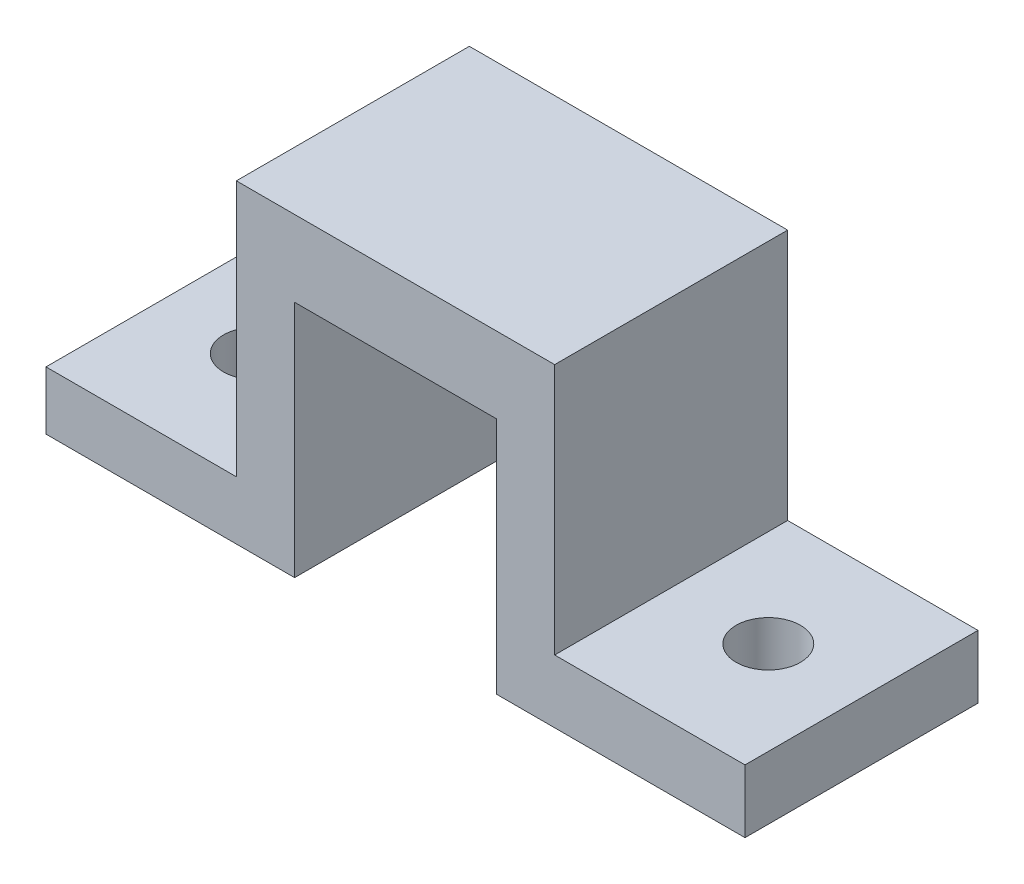
ISO-10303-21;
HEADER;
FILE_DESCRIPTION(('STEP AP214'),'2;1');
FILE_NAME('part.step','',(''),(''),'','','');
FILE_SCHEMA(('AUTOMOTIVE_DESIGN { 1 0 10303 214 1 1 1 1 }'));
ENDSEC;
DATA;
#1=APPLICATION_CONTEXT('core data for automotive mechanical design processes');
#2=APPLICATION_PROTOCOL_DEFINITION('international standard','automotive_design',2000,#1);
#3=PRODUCT_CONTEXT('',#1,'mechanical');
#4=PRODUCT('Part','Part','',(#3));
#5=PRODUCT_RELATED_PRODUCT_CATEGORY('part','',(#4));
#6=PRODUCT_DEFINITION_FORMATION('','',#4);
#7=PRODUCT_DEFINITION_CONTEXT('part definition',#1,'design');
#8=PRODUCT_DEFINITION('design','',#6,#7);
#9=PRODUCT_DEFINITION_SHAPE('','',#8);
#10=(LENGTH_UNIT() NAMED_UNIT(*) SI_UNIT(.MILLI.,.METRE.));
#11=(NAMED_UNIT(*) PLANE_ANGLE_UNIT() SI_UNIT($,.RADIAN.));
#12=(NAMED_UNIT(*) SI_UNIT($,.STERADIAN.) SOLID_ANGLE_UNIT());
#13=UNCERTAINTY_MEASURE_WITH_UNIT(LENGTH_MEASURE(1.E-05),#10,'distance_accuracy_value','');
#14=(GEOMETRIC_REPRESENTATION_CONTEXT(3) GLOBAL_UNCERTAINTY_ASSIGNED_CONTEXT((#13)) GLOBAL_UNIT_ASSIGNED_CONTEXT((#10,
#11,#12)) REPRESENTATION_CONTEXT('',''));
#15=CARTESIAN_POINT('',(0.,0.,0.));
#16=DIRECTION('',(0.,0.,1.));
#17=DIRECTION('',(1.,0.,0.));
#18=AXIS2_PLACEMENT_3D('',#15,#16,#17);
#19=CARTESIAN_POINT('',(5.5,-6.5,12.7));
#20=DIRECTION('',(1.,0.,0.));
#21=DIRECTION('',(0.,0.,-1.));
#22=AXIS2_PLACEMENT_3D('',#19,#20,#21);
#23=PLANE('',#22);
#24=DIRECTION('',(0.,-1.,0.));
#25=VECTOR('',#24,1.);
#26=CARTESIAN_POINT('',(5.5,-6.5,0.));
#27=LINE('',#26,#25);
#28=CARTESIAN_POINT('',(5.5,6.5,0.));
#29=VERTEX_POINT('',#28);
#30=CARTESIAN_POINT('',(5.5,-6.5,0.));
#31=VERTEX_POINT('',#30);
#32=EDGE_CURVE('E152',#29,#31,#27,.T.);
#33=ORIENTED_EDGE('',*,*,#32,.T.);
#34=DIRECTION('',(0.,0.,-1.));
#35=VECTOR('',#34,1.);
#36=CARTESIAN_POINT('',(5.5,-6.5,12.7));
#37=LINE('',#36,#35);
#38=CARTESIAN_POINT('',(5.5,-6.5,12.7));
#39=VERTEX_POINT('',#38);
#40=EDGE_CURVE('E11',#39,#31,#37,.T.);
#41=ORIENTED_EDGE('',*,*,#40,.F.);
#42=DIRECTION('',(0.,-1.,0.));
#43=VECTOR('',#42,1.);
#44=CARTESIAN_POINT('',(5.5,-6.5,12.7));
#45=LINE('',#44,#43);
#46=CARTESIAN_POINT('',(5.5,6.5,12.7));
#47=VERTEX_POINT('',#46);
#48=EDGE_CURVE('E175',#47,#39,#45,.T.);
#49=ORIENTED_EDGE('',*,*,#48,.F.);
#50=DIRECTION('',(0.,0.,-1.));
#51=VECTOR('',#50,1.);
#52=CARTESIAN_POINT('',(5.5,6.5,12.7));
#53=LINE('',#52,#51);
#54=EDGE_CURVE('E148',#47,#29,#53,.T.);
#55=ORIENTED_EDGE('',*,*,#54,.T.);
#56=EDGE_LOOP('',(#33,#41,#49,#55));
#57=FACE_BOUND('',#56,.T.);
#58=ADVANCED_FACE('F32',(#57),#23,.F.);
#59=CARTESIAN_POINT('',(19.05,-6.5,12.7));
#60=DIRECTION('',(0.,1.,0.));
#61=DIRECTION('',(-1.,0.,0.));
#62=AXIS2_PLACEMENT_3D('',#59,#60,#61);
#63=PLANE('',#62);
#64=CARTESIAN_POINT('',(13.97,-6.5,6.35));
#65=DIRECTION('',(0.,1.,0.));
#66=DIRECTION('',(0.,0.,1.));
#67=AXIS2_PLACEMENT_3D('',#64,#65,#66);
#68=CIRCLE('',#67,1.7526);
#69=CARTESIAN_POINT('',(13.97,-6.5,8.1026));
#70=VERTEX_POINT('',#69);
#71=EDGE_CURVE('E292',#70,#70,#68,.T.);
#72=ORIENTED_EDGE('',*,*,#71,.T.);
#73=EDGE_LOOP('',(#72));
#74=FACE_BOUND('',#73,.T.);
#75=DIRECTION('',(1.,0.,0.));
#76=VECTOR('',#75,1.);
#77=CARTESIAN_POINT('',(19.05,-6.5,0.));
#78=LINE('',#77,#76);
#79=CARTESIAN_POINT('',(19.05,-6.5,0.));
#80=VERTEX_POINT('',#79);
#81=EDGE_CURVE('E155',#31,#80,#78,.T.);
#82=ORIENTED_EDGE('',*,*,#81,.T.);
#83=DIRECTION('',(0.,0.,-1.));
#84=VECTOR('',#83,1.);
#85=CARTESIAN_POINT('',(19.05,-6.5,12.7));
#86=LINE('',#85,#84);
#87=CARTESIAN_POINT('',(19.05,-6.5,12.7));
#88=VERTEX_POINT('',#87);
#89=EDGE_CURVE('E40',#88,#80,#86,.T.);
#90=ORIENTED_EDGE('',*,*,#89,.F.);
#91=DIRECTION('',(1.,0.,0.));
#92=VECTOR('',#91,1.);
#93=CARTESIAN_POINT('',(19.05,-6.5,12.7));
#94=LINE('',#93,#92);
#95=EDGE_CURVE('E103',#39,#88,#94,.T.);
#96=ORIENTED_EDGE('',*,*,#95,.F.);
#97=ORIENTED_EDGE('',*,*,#40,.T.);
#98=EDGE_LOOP('',(#82,#90,#96,#97));
#99=FACE_BOUND('',#98,.T.);
#100=ADVANCED_FACE('F253',(#74,#99),#63,.F.);
#101=CARTESIAN_POINT('',(19.05,-3.06304910198319,12.7));
#102=DIRECTION('',(-1.,0.,0.));
#103=DIRECTION('',(0.,0.,1.));
#104=AXIS2_PLACEMENT_3D('',#101,#102,#103);
#105=PLANE('',#104);
#106=DIRECTION('',(0.,1.,0.));
#107=VECTOR('',#106,1.);
#108=CARTESIAN_POINT('',(19.05,-3.06304910198319,0.));
#109=LINE('',#108,#107);
#110=CARTESIAN_POINT('',(19.05,-3.06304910198319,0.));
#111=VERTEX_POINT('',#110);
#112=EDGE_CURVE('E158',#80,#111,#109,.T.);
#113=ORIENTED_EDGE('',*,*,#112,.T.);
#114=DIRECTION('',(0.,0.,-1.));
#115=VECTOR('',#114,1.);
#116=CARTESIAN_POINT('',(19.05,-3.06304910198319,12.7));
#117=LINE('',#116,#115);
#118=CARTESIAN_POINT('',(19.05,-3.06304910198319,12.7));
#119=VERTEX_POINT('',#118);
#120=EDGE_CURVE('E194',#119,#111,#117,.T.);
#121=ORIENTED_EDGE('',*,*,#120,.F.);
#122=DIRECTION('',(0.,1.,0.));
#123=VECTOR('',#122,1.);
#124=CARTESIAN_POINT('',(19.05,-3.06304910198319,12.7));
#125=LINE('',#124,#123);
#126=EDGE_CURVE('E202',#88,#119,#125,.T.);
#127=ORIENTED_EDGE('',*,*,#126,.F.);
#128=ORIENTED_EDGE('',*,*,#89,.T.);
#129=EDGE_LOOP('',(#113,#121,#127,#128));
#130=FACE_BOUND('',#129,.T.);
#131=ADVANCED_FACE('F200',(#130),#105,.F.);
#132=CARTESIAN_POINT('',(8.675,-3.06304910198319,12.7));
#133=DIRECTION('',(0.,-1.,0.));
#134=DIRECTION('',(0.,0.,-1.));
#135=AXIS2_PLACEMENT_3D('',#132,#133,#134);
#136=PLANE('',#135);
#137=CARTESIAN_POINT('',(13.97,-3.06304910198319,6.35));
#138=DIRECTION('',(0.,1.,0.));
#139=DIRECTION('',(0.,0.,1.));
#140=AXIS2_PLACEMENT_3D('',#137,#138,#139);
#141=CIRCLE('',#140,1.7526);
#142=CARTESIAN_POINT('',(13.97,-3.06304910198319,8.1026));
#143=VERTEX_POINT('',#142);
#144=EDGE_CURVE('E295',#143,#143,#141,.T.);
#145=ORIENTED_EDGE('',*,*,#144,.F.);
#146=EDGE_LOOP('',(#145));
#147=FACE_BOUND('',#146,.T.);
#148=DIRECTION('',(-1.,0.,0.));
#149=VECTOR('',#148,1.);
#150=CARTESIAN_POINT('',(8.675,-3.06304910198319,0.));
#151=LINE('',#150,#149);
#152=CARTESIAN_POINT('',(8.675,-3.06304910198319,0.));
#153=VERTEX_POINT('',#152);
#154=EDGE_CURVE('E160',#111,#153,#151,.T.);
#155=ORIENTED_EDGE('',*,*,#154,.T.);
#156=DIRECTION('',(0.,0.,-1.));
#157=VECTOR('',#156,1.);
#158=CARTESIAN_POINT('',(8.675,-3.06304910198319,12.7));
#159=LINE('',#158,#157);
#160=CARTESIAN_POINT('',(8.675,-3.06304910198319,12.7));
#161=VERTEX_POINT('',#160);
#162=EDGE_CURVE('E191',#161,#153,#159,.T.);
#163=ORIENTED_EDGE('',*,*,#162,.F.);
#164=DIRECTION('',(-1.,0.,0.));
#165=VECTOR('',#164,1.);
#166=CARTESIAN_POINT('',(8.675,-3.06304910198319,12.7));
#167=LINE('',#166,#165);
#168=EDGE_CURVE('E220',#119,#161,#167,.T.);
#169=ORIENTED_EDGE('',*,*,#168,.F.);
#170=ORIENTED_EDGE('',*,*,#120,.T.);
#171=EDGE_LOOP('',(#155,#163,#169,#170));
#172=FACE_BOUND('',#171,.T.);
#173=ADVANCED_FACE('F211',(#147,#172),#136,.F.);
#174=CARTESIAN_POINT('',(8.675,10.645,12.7));
#175=DIRECTION('',(-1.,0.,0.));
#176=DIRECTION('',(0.,-1.,0.));
#177=AXIS2_PLACEMENT_3D('',#174,#175,#176);
#178=PLANE('',#177);
#179=DIRECTION('',(0.,1.,0.));
#180=VECTOR('',#179,1.);
#181=CARTESIAN_POINT('',(8.675,10.645,0.));
#182=LINE('',#181,#180);
#183=CARTESIAN_POINT('',(8.675,10.645,0.));
#184=VERTEX_POINT('',#183);
#185=EDGE_CURVE('E162',#153,#184,#182,.T.);
#186=ORIENTED_EDGE('',*,*,#185,.T.);
#187=DIRECTION('',(0.,0.,-1.));
#188=VECTOR('',#187,1.);
#189=CARTESIAN_POINT('',(8.675,10.645,12.7));
#190=LINE('',#189,#188);
#191=CARTESIAN_POINT('',(8.675,10.645,12.7));
#192=VERTEX_POINT('',#191);
#193=EDGE_CURVE('E188',#192,#184,#190,.T.);
#194=ORIENTED_EDGE('',*,*,#193,.F.);
#195=DIRECTION('',(0.,1.,0.));
#196=VECTOR('',#195,1.);
#197=CARTESIAN_POINT('',(8.675,10.645,12.7));
#198=LINE('',#197,#196);
#199=EDGE_CURVE('E217',#161,#192,#198,.T.);
#200=ORIENTED_EDGE('',*,*,#199,.F.);
#201=ORIENTED_EDGE('',*,*,#162,.T.);
#202=EDGE_LOOP('',(#186,#194,#200,#201));
#203=FACE_BOUND('',#202,.T.);
#204=ADVANCED_FACE('F215',(#203),#178,.F.);
#205=CARTESIAN_POINT('',(-8.675,10.645,12.7));
#206=DIRECTION('',(0.,-1.,0.));
#207=DIRECTION('',(0.,0.,-1.));
#208=AXIS2_PLACEMENT_3D('',#205,#206,#207);
#209=PLANE('',#208);
#210=DIRECTION('',(-1.,0.,0.));
#211=VECTOR('',#210,1.);
#212=CARTESIAN_POINT('',(-8.675,10.645,0.));
#213=LINE('',#212,#211);
#214=CARTESIAN_POINT('',(-8.675,10.645,0.));
#215=VERTEX_POINT('',#214);
#216=EDGE_CURVE('E164',#184,#215,#213,.T.);
#217=ORIENTED_EDGE('',*,*,#216,.T.);
#218=DIRECTION('',(0.,0.,-1.));
#219=VECTOR('',#218,1.);
#220=CARTESIAN_POINT('',(-8.675,10.645,12.7));
#221=LINE('',#220,#219);
#222=CARTESIAN_POINT('',(-8.675,10.645,12.7));
#223=VERTEX_POINT('',#222);
#224=EDGE_CURVE('E185',#223,#215,#221,.T.);
#225=ORIENTED_EDGE('',*,*,#224,.F.);
#226=DIRECTION('',(-1.,0.,0.));
#227=VECTOR('',#226,1.);
#228=CARTESIAN_POINT('',(-8.675,10.645,12.7));
#229=LINE('',#228,#227);
#230=EDGE_CURVE('E219',#192,#223,#229,.T.);
#231=ORIENTED_EDGE('',*,*,#230,.F.);
#232=ORIENTED_EDGE('',*,*,#193,.T.);
#233=EDGE_LOOP('',(#217,#225,#231,#232));
#234=FACE_BOUND('',#233,.T.);
#235=ADVANCED_FACE('F269',(#234),#209,.F.);
#236=CARTESIAN_POINT('',(-8.675,-3.325,12.7));
#237=DIRECTION('',(1.,0.,0.));
#238=DIRECTION('',(0.,0.,-1.));
#239=AXIS2_PLACEMENT_3D('',#236,#237,#238);
#240=PLANE('',#239);
#241=DIRECTION('',(0.,-1.,0.));
#242=VECTOR('',#241,1.);
#243=CARTESIAN_POINT('',(-8.675,-3.325,0.));
#244=LINE('',#243,#242);
#245=CARTESIAN_POINT('',(-8.675,-3.325,0.));
#246=VERTEX_POINT('',#245);
#247=EDGE_CURVE('E166',#215,#246,#244,.T.);
#248=ORIENTED_EDGE('',*,*,#247,.T.);
#249=DIRECTION('',(0.,0.,-1.));
#250=VECTOR('',#249,1.);
#251=CARTESIAN_POINT('',(-8.675,-3.325,12.7));
#252=LINE('',#251,#250);
#253=CARTESIAN_POINT('',(-8.675,-3.325,12.7));
#254=VERTEX_POINT('',#253);
#255=EDGE_CURVE('E182',#254,#246,#252,.T.);
#256=ORIENTED_EDGE('',*,*,#255,.F.);
#257=DIRECTION('',(0.,-1.,0.));
#258=VECTOR('',#257,1.);
#259=CARTESIAN_POINT('',(-8.675,-3.325,12.7));
#260=LINE('',#259,#258);
#261=EDGE_CURVE('E222',#223,#254,#260,.T.);
#262=ORIENTED_EDGE('',*,*,#261,.F.);
#263=ORIENTED_EDGE('',*,*,#224,.T.);
#264=EDGE_LOOP('',(#248,#256,#262,#263));
#265=FACE_BOUND('',#264,.T.);
#266=ADVANCED_FACE('F272',(#265),#240,.F.);
#267=CARTESIAN_POINT('',(-19.05,-3.325,12.7));
#268=DIRECTION('',(0.,-1.,0.));
#269=DIRECTION('',(0.,0.,-1.));
#270=AXIS2_PLACEMENT_3D('',#267,#268,#269);
#271=PLANE('',#270);
#272=CARTESIAN_POINT('',(-13.97,-3.325,6.35));
#273=DIRECTION('',(0.,1.,0.));
#274=DIRECTION('',(0.,0.,1.));
#275=AXIS2_PLACEMENT_3D('',#272,#273,#274);
#276=CIRCLE('',#275,1.7526);
#277=CARTESIAN_POINT('',(-13.97,-3.325,8.1026));
#278=VERTEX_POINT('',#277);
#279=EDGE_CURVE('E289',#278,#278,#276,.T.);
#280=ORIENTED_EDGE('',*,*,#279,.F.);
#281=EDGE_LOOP('',(#280));
#282=FACE_BOUND('',#281,.T.);
#283=DIRECTION('',(-1.,0.,0.));
#284=VECTOR('',#283,1.);
#285=CARTESIAN_POINT('',(-19.05,-3.325,0.));
#286=LINE('',#285,#284);
#287=CARTESIAN_POINT('',(-19.05,-3.325,0.));
#288=VERTEX_POINT('',#287);
#289=EDGE_CURVE('E168',#246,#288,#286,.T.);
#290=ORIENTED_EDGE('',*,*,#289,.T.);
#291=DIRECTION('',(0.,0.,-1.));
#292=VECTOR('',#291,1.);
#293=CARTESIAN_POINT('',(-19.05,-3.325,12.7));
#294=LINE('',#293,#292);
#295=CARTESIAN_POINT('',(-19.05,-3.325,12.7));
#296=VERTEX_POINT('',#295);
#297=EDGE_CURVE('E179',#296,#288,#294,.T.);
#298=ORIENTED_EDGE('',*,*,#297,.F.);
#299=DIRECTION('',(-1.,0.,0.));
#300=VECTOR('',#299,1.);
#301=CARTESIAN_POINT('',(-19.05,-3.325,12.7));
#302=LINE('',#301,#300);
#303=EDGE_CURVE('E228',#254,#296,#302,.T.);
#304=ORIENTED_EDGE('',*,*,#303,.F.);
#305=ORIENTED_EDGE('',*,*,#255,.T.);
#306=EDGE_LOOP('',(#290,#298,#304,#305));
#307=FACE_BOUND('',#306,.T.);
#308=ADVANCED_FACE('F234',(#282,#307),#271,.F.);
#309=CARTESIAN_POINT('',(-19.05,-6.5,12.7));
#310=DIRECTION('',(1.,0.,0.));
#311=DIRECTION('',(0.,0.,-1.));
#312=AXIS2_PLACEMENT_3D('',#309,#310,#311);
#313=PLANE('',#312);
#314=DIRECTION('',(0.,-1.,0.));
#315=VECTOR('',#314,1.);
#316=CARTESIAN_POINT('',(-19.05,-6.5,0.));
#317=LINE('',#316,#315);
#318=CARTESIAN_POINT('',(-19.05,-6.5,0.));
#319=VERTEX_POINT('',#318);
#320=EDGE_CURVE('E170',#288,#319,#317,.T.);
#321=ORIENTED_EDGE('',*,*,#320,.T.);
#322=DIRECTION('',(0.,0.,-1.));
#323=VECTOR('',#322,1.);
#324=CARTESIAN_POINT('',(-19.05,-6.5,12.7));
#325=LINE('',#324,#323);
#326=CARTESIAN_POINT('',(-19.05,-6.5,12.7));
#327=VERTEX_POINT('',#326);
#328=EDGE_CURVE('E143',#327,#319,#325,.T.);
#329=ORIENTED_EDGE('',*,*,#328,.F.);
#330=DIRECTION('',(0.,-1.,0.));
#331=VECTOR('',#330,1.);
#332=CARTESIAN_POINT('',(-19.05,-6.5,12.7));
#333=LINE('',#332,#331);
#334=EDGE_CURVE('E134',#296,#327,#333,.T.);
#335=ORIENTED_EDGE('',*,*,#334,.F.);
#336=ORIENTED_EDGE('',*,*,#297,.T.);
#337=EDGE_LOOP('',(#321,#329,#335,#336));
#338=FACE_BOUND('',#337,.T.);
#339=ADVANCED_FACE('F238',(#338),#313,.F.);
#340=CARTESIAN_POINT('',(-5.5,-6.5,12.7));
#341=DIRECTION('',(0.,1.,0.));
#342=DIRECTION('',(-1.,0.,0.));
#343=AXIS2_PLACEMENT_3D('',#340,#341,#342);
#344=PLANE('',#343);
#345=CARTESIAN_POINT('',(-13.97,-6.5,6.35));
#346=DIRECTION('',(0.,1.,0.));
#347=DIRECTION('',(0.,0.,1.));
#348=AXIS2_PLACEMENT_3D('',#345,#346,#347);
#349=CIRCLE('',#348,1.7526);
#350=CARTESIAN_POINT('',(-13.97,-6.5,8.1026));
#351=VERTEX_POINT('',#350);
#352=EDGE_CURVE('E156',#351,#351,#349,.T.);
#353=ORIENTED_EDGE('',*,*,#352,.T.);
#354=EDGE_LOOP('',(#353));
#355=FACE_BOUND('',#354,.T.);
#356=DIRECTION('',(1.,0.,0.));
#357=VECTOR('',#356,1.);
#358=CARTESIAN_POINT('',(-5.5,-6.5,0.));
#359=LINE('',#358,#357);
#360=CARTESIAN_POINT('',(-5.5,-6.5,0.));
#361=VERTEX_POINT('',#360);
#362=EDGE_CURVE('E142',#319,#361,#359,.T.);
#363=ORIENTED_EDGE('',*,*,#362,.T.);
#364=DIRECTION('',(0.,0.,-1.));
#365=VECTOR('',#364,1.);
#366=CARTESIAN_POINT('',(-5.5,-6.5,12.7));
#367=LINE('',#366,#365);
#368=CARTESIAN_POINT('',(-5.5,-6.5,12.7));
#369=VERTEX_POINT('',#368);
#370=EDGE_CURVE('E139',#369,#361,#367,.T.);
#371=ORIENTED_EDGE('',*,*,#370,.F.);
#372=DIRECTION('',(1.,0.,0.));
#373=VECTOR('',#372,1.);
#374=CARTESIAN_POINT('',(-5.5,-6.5,12.7));
#375=LINE('',#374,#373);
#376=EDGE_CURVE('E128',#327,#369,#375,.T.);
#377=ORIENTED_EDGE('',*,*,#376,.F.);
#378=ORIENTED_EDGE('',*,*,#328,.T.);
#379=EDGE_LOOP('',(#363,#371,#377,#378));
#380=FACE_BOUND('',#379,.T.);
#381=ADVANCED_FACE('F140',(#355,#380),#344,.F.);
#382=CARTESIAN_POINT('',(-5.5,-6.5,12.7));
#383=DIRECTION('',(-1.,0.,0.));
#384=DIRECTION('',(0.,0.,1.));
#385=AXIS2_PLACEMENT_3D('',#382,#383,#384);
#386=PLANE('',#385);
#387=DIRECTION('',(0.,1.,0.));
#388=VECTOR('',#387,1.);
#389=CARTESIAN_POINT('',(-5.5,-6.5,0.));
#390=LINE('',#389,#388);
#391=CARTESIAN_POINT('',(-5.5,6.5,0.));
#392=VERTEX_POINT('',#391);
#393=EDGE_CURVE('E89',#361,#392,#390,.T.);
#394=ORIENTED_EDGE('',*,*,#393,.T.);
#395=DIRECTION('',(0.,0.,-1.));
#396=VECTOR('',#395,1.);
#397=CARTESIAN_POINT('',(-5.5,6.5,12.7));
#398=LINE('',#397,#396);
#399=CARTESIAN_POINT('',(-5.5,6.5,12.7));
#400=VERTEX_POINT('',#399);
#401=EDGE_CURVE('E144',#400,#392,#398,.T.);
#402=ORIENTED_EDGE('',*,*,#401,.F.);
#403=DIRECTION('',(0.,1.,0.));
#404=VECTOR('',#403,1.);
#405=CARTESIAN_POINT('',(-5.5,-6.5,12.7));
#406=LINE('',#405,#404);
#407=EDGE_CURVE('E132',#369,#400,#406,.T.);
#408=ORIENTED_EDGE('',*,*,#407,.F.);
#409=ORIENTED_EDGE('',*,*,#370,.T.);
#410=EDGE_LOOP('',(#394,#402,#408,#409));
#411=FACE_BOUND('',#410,.T.);
#412=ADVANCED_FACE('F146',(#411),#386,.F.);
#413=CARTESIAN_POINT('',(-5.5,6.5,12.7));
#414=DIRECTION('',(0.,1.,0.));
#415=DIRECTION('',(0.,0.,1.));
#416=AXIS2_PLACEMENT_3D('',#413,#414,#415);
#417=PLANE('',#416);
#418=DIRECTION('',(1.,0.,0.));
#419=VECTOR('',#418,1.);
#420=CARTESIAN_POINT('',(-5.5,6.5,0.));
#421=LINE('',#420,#419);
#422=EDGE_CURVE('E95',#392,#29,#421,.T.);
#423=ORIENTED_EDGE('',*,*,#422,.T.);
#424=ORIENTED_EDGE('',*,*,#54,.F.);
#425=DIRECTION('',(1.,0.,0.));
#426=VECTOR('',#425,1.);
#427=CARTESIAN_POINT('',(-5.5,6.5,12.7));
#428=LINE('',#427,#426);
#429=EDGE_CURVE('E48',#400,#47,#428,.T.);
#430=ORIENTED_EDGE('',*,*,#429,.F.);
#431=ORIENTED_EDGE('',*,*,#401,.T.);
#432=EDGE_LOOP('',(#423,#424,#430,#431));
#433=FACE_BOUND('',#432,.T.);
#434=ADVANCED_FACE('F242',(#433),#417,.F.);
#435=CARTESIAN_POINT('',(0.,0.,12.7));
#436=DIRECTION('',(0.,0.,-1.));
#437=DIRECTION('',(-1.,0.,0.));
#438=AXIS2_PLACEMENT_3D('',#435,#436,#437);
#439=PLANE('',#438);
#440=ORIENTED_EDGE('',*,*,#48,.T.);
#441=ORIENTED_EDGE('',*,*,#95,.T.);
#442=ORIENTED_EDGE('',*,*,#126,.T.);
#443=ORIENTED_EDGE('',*,*,#168,.T.);
#444=ORIENTED_EDGE('',*,*,#199,.T.);
#445=ORIENTED_EDGE('',*,*,#230,.T.);
#446=ORIENTED_EDGE('',*,*,#261,.T.);
#447=ORIENTED_EDGE('',*,*,#303,.T.);
#448=ORIENTED_EDGE('',*,*,#334,.T.);
#449=ORIENTED_EDGE('',*,*,#376,.T.);
#450=ORIENTED_EDGE('',*,*,#407,.T.);
#451=ORIENTED_EDGE('',*,*,#429,.T.);
#452=EDGE_LOOP('',(#440,#441,#442,#443,#444,#445,#446,#447,#448,#449,#450,#451));
#453=FACE_BOUND('',#452,.T.);
#454=ADVANCED_FACE('F130',(#453),#439,.F.);
#455=CARTESIAN_POINT('',(0.,0.,0.));
#456=DIRECTION('',(0.,0.,-1.));
#457=DIRECTION('',(-1.,0.,0.));
#458=AXIS2_PLACEMENT_3D('',#455,#456,#457);
#459=PLANE('',#458);
#460=ORIENTED_EDGE('',*,*,#32,.F.);
#461=ORIENTED_EDGE('',*,*,#422,.F.);
#462=ORIENTED_EDGE('',*,*,#393,.F.);
#463=ORIENTED_EDGE('',*,*,#362,.F.);
#464=ORIENTED_EDGE('',*,*,#320,.F.);
#465=ORIENTED_EDGE('',*,*,#289,.F.);
#466=ORIENTED_EDGE('',*,*,#247,.F.);
#467=ORIENTED_EDGE('',*,*,#216,.F.);
#468=ORIENTED_EDGE('',*,*,#185,.F.);
#469=ORIENTED_EDGE('',*,*,#154,.F.);
#470=ORIENTED_EDGE('',*,*,#112,.F.);
#471=ORIENTED_EDGE('',*,*,#81,.F.);
#472=EDGE_LOOP('',(#460,#461,#462,#463,#464,#465,#466,#467,#468,#469,#470,#471));
#473=FACE_BOUND('',#472,.T.);
#474=ADVANCED_FACE('F206',(#473),#459,.T.);
#475=CARTESIAN_POINT('',(-13.97,-6.5,6.35));
#476=DIRECTION('',(0.,1.,0.));
#477=DIRECTION('',(0.,0.,1.));
#478=AXIS2_PLACEMENT_3D('',#475,#476,#477);
#479=CYLINDRICAL_SURFACE('',#478,1.7526);
#480=ORIENTED_EDGE('',*,*,#352,.F.);
#481=EDGE_LOOP('',(#480));
#482=FACE_BOUND('',#481,.T.);
#483=ORIENTED_EDGE('',*,*,#279,.T.);
#484=EDGE_LOOP('',(#483));
#485=FACE_BOUND('',#484,.T.);
#486=ADVANCED_FACE('F305',(#482,#485),#479,.F.);
#487=CARTESIAN_POINT('',(13.97,-6.5,6.35));
#488=DIRECTION('',(0.,1.,0.));
#489=DIRECTION('',(0.,0.,1.));
#490=AXIS2_PLACEMENT_3D('',#487,#488,#489);
#491=CYLINDRICAL_SURFACE('',#490,1.7526);
#492=ORIENTED_EDGE('',*,*,#71,.F.);
#493=EDGE_LOOP('',(#492));
#494=FACE_BOUND('',#493,.T.);
#495=ORIENTED_EDGE('',*,*,#144,.T.);
#496=EDGE_LOOP('',(#495));
#497=FACE_BOUND('',#496,.T.);
#498=ADVANCED_FACE('F302',(#494,#497),#491,.F.);
#499=CLOSED_SHELL('',(#58,#100,#131,#173,#204,#235,#266,#308,#339,#381,#412,#434,#454,#474,#486,#498));
#500=MANIFOLD_SOLID_BREP('B2',#499);
#501=ADVANCED_BREP_SHAPE_REPRESENTATION('',(#18,#500),#14);
#502=SHAPE_DEFINITION_REPRESENTATION(#9,#501);
ENDSEC;
END-ISO-10303-21;
